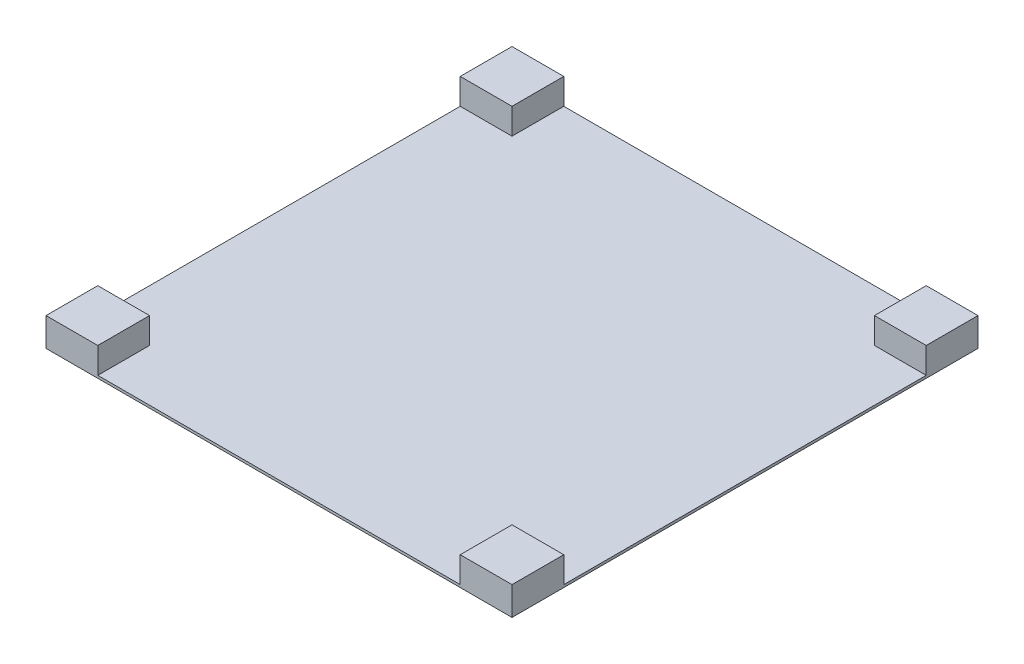
ISO-10303-21;
HEADER;
FILE_DESCRIPTION(('STEP AP214'),'2;1');
FILE_NAME('part.step','',(''),(''),'','','');
FILE_SCHEMA(('AUTOMOTIVE_DESIGN { 1 0 10303 214 1 1 1 1 }'));
ENDSEC;
DATA;
#1=APPLICATION_CONTEXT('core data for automotive mechanical design processes');
#2=APPLICATION_PROTOCOL_DEFINITION('international standard','automotive_design',2000,#1);
#3=PRODUCT_CONTEXT('',#1,'mechanical');
#4=PRODUCT('Part','Part','',(#3));
#5=PRODUCT_RELATED_PRODUCT_CATEGORY('part','',(#4));
#6=PRODUCT_DEFINITION_FORMATION('','',#4);
#7=PRODUCT_DEFINITION_CONTEXT('part definition',#1,'design');
#8=PRODUCT_DEFINITION('design','',#6,#7);
#9=PRODUCT_DEFINITION_SHAPE('','',#8);
#10=(LENGTH_UNIT() NAMED_UNIT(*) SI_UNIT(.MILLI.,.METRE.));
#11=(NAMED_UNIT(*) PLANE_ANGLE_UNIT() SI_UNIT($,.RADIAN.));
#12=(NAMED_UNIT(*) SI_UNIT($,.STERADIAN.) SOLID_ANGLE_UNIT());
#13=UNCERTAINTY_MEASURE_WITH_UNIT(LENGTH_MEASURE(1.E-05),#10,'distance_accuracy_value','');
#14=(GEOMETRIC_REPRESENTATION_CONTEXT(3) GLOBAL_UNCERTAINTY_ASSIGNED_CONTEXT((#13)) GLOBAL_UNIT_ASSIGNED_CONTEXT((#10,
#11,#12)) REPRESENTATION_CONTEXT('',''));
#15=CARTESIAN_POINT('',(0.,0.,0.));
#16=DIRECTION('',(0.,0.,1.));
#17=DIRECTION('',(1.,0.,0.));
#18=AXIS2_PLACEMENT_3D('',#15,#16,#17);
#19=CARTESIAN_POINT('',(0.,5.,0.));
#20=DIRECTION('',(0.,1.,0.));
#21=DIRECTION('',(0.,0.,1.));
#22=AXIS2_PLACEMENT_3D('',#19,#20,#21);
#23=PLANE('',#22);
#24=DIRECTION('',(-1.,0.,0.));
#25=VECTOR('',#24,1.);
#26=CARTESIAN_POINT('',(-450.,5.,350.));
#27=LINE('',#26,#25);
#28=CARTESIAN_POINT('',(-350.,5.,350.));
#29=VERTEX_POINT('',#28);
#30=CARTESIAN_POINT('',(-450.,5.,350.));
#31=VERTEX_POINT('',#30);
#32=EDGE_CURVE('E55',#29,#31,#27,.T.);
#33=ORIENTED_EDGE('',*,*,#32,.F.);
#34=DIRECTION('',(0.,0.,-1.));
#35=VECTOR('',#34,1.);
#36=CARTESIAN_POINT('',(-350.,5.,350.));
#37=LINE('',#36,#35);
#38=CARTESIAN_POINT('',(-350.,5.,450.));
#39=VERTEX_POINT('',#38);
#40=EDGE_CURVE('E176',#39,#29,#37,.T.);
#41=ORIENTED_EDGE('',*,*,#40,.F.);
#42=DIRECTION('',(1.,0.,0.));
#43=VECTOR('',#42,1.);
#44=CARTESIAN_POINT('',(-450.,5.,450.));
#45=LINE('',#44,#43);
#46=CARTESIAN_POINT('',(350.,5.,450.));
#47=VERTEX_POINT('',#46);
#48=EDGE_CURVE('E293',#39,#47,#45,.T.);
#49=ORIENTED_EDGE('',*,*,#48,.T.);
#50=DIRECTION('',(0.,0.,1.));
#51=VECTOR('',#50,1.);
#52=CARTESIAN_POINT('',(350.,5.,350.));
#53=LINE('',#52,#51);
#54=CARTESIAN_POINT('',(350.,5.,350.));
#55=VERTEX_POINT('',#54);
#56=EDGE_CURVE('E183',#55,#47,#53,.T.);
#57=ORIENTED_EDGE('',*,*,#56,.F.);
#58=DIRECTION('',(-1.,0.,0.));
#59=VECTOR('',#58,1.);
#60=CARTESIAN_POINT('',(350.,5.,350.));
#61=LINE('',#60,#59);
#62=CARTESIAN_POINT('',(450.,5.,350.));
#63=VERTEX_POINT('',#62);
#64=EDGE_CURVE('E178',#63,#55,#61,.T.);
#65=ORIENTED_EDGE('',*,*,#64,.F.);
#66=DIRECTION('',(0.,0.,-1.));
#67=VECTOR('',#66,1.);
#68=CARTESIAN_POINT('',(450.,5.,-450.));
#69=LINE('',#68,#67);
#70=CARTESIAN_POINT('',(450.,5.,-350.));
#71=VERTEX_POINT('',#70);
#72=EDGE_CURVE('E284',#63,#71,#69,.T.);
#73=ORIENTED_EDGE('',*,*,#72,.T.);
#74=DIRECTION('',(1.,0.,0.));
#75=VECTOR('',#74,1.);
#76=CARTESIAN_POINT('',(350.,5.,-350.));
#77=LINE('',#76,#75);
#78=CARTESIAN_POINT('',(350.,5.,-350.));
#79=VERTEX_POINT('',#78);
#80=EDGE_CURVE('E224',#79,#71,#77,.T.);
#81=ORIENTED_EDGE('',*,*,#80,.F.);
#82=DIRECTION('',(0.,0.,1.));
#83=VECTOR('',#82,1.);
#84=CARTESIAN_POINT('',(350.,5.,-450.));
#85=LINE('',#84,#83);
#86=CARTESIAN_POINT('',(350.,5.,-450.));
#87=VERTEX_POINT('',#86);
#88=EDGE_CURVE('E218',#87,#79,#85,.T.);
#89=ORIENTED_EDGE('',*,*,#88,.F.);
#90=DIRECTION('',(-1.,0.,0.));
#91=VECTOR('',#90,1.);
#92=CARTESIAN_POINT('',(-450.,5.,-450.));
#93=LINE('',#92,#91);
#94=CARTESIAN_POINT('',(-350.,5.,-450.));
#95=VERTEX_POINT('',#94);
#96=EDGE_CURVE('E287',#87,#95,#93,.T.);
#97=ORIENTED_EDGE('',*,*,#96,.T.);
#98=DIRECTION('',(0.,0.,-1.));
#99=VECTOR('',#98,1.);
#100=CARTESIAN_POINT('',(-350.,5.,-450.));
#101=LINE('',#100,#99);
#102=CARTESIAN_POINT('',(-350.,5.,-350.));
#103=VERTEX_POINT('',#102);
#104=EDGE_CURVE('E249',#103,#95,#101,.T.);
#105=ORIENTED_EDGE('',*,*,#104,.F.);
#106=DIRECTION('',(1.,0.,0.));
#107=VECTOR('',#106,1.);
#108=CARTESIAN_POINT('',(-450.,5.,-350.));
#109=LINE('',#108,#107);
#110=CARTESIAN_POINT('',(-450.,5.,-350.));
#111=VERTEX_POINT('',#110);
#112=EDGE_CURVE('E255',#111,#103,#109,.T.);
#113=ORIENTED_EDGE('',*,*,#112,.F.);
#114=DIRECTION('',(0.,0.,1.));
#115=VECTOR('',#114,1.);
#116=CARTESIAN_POINT('',(-450.,5.,-450.));
#117=LINE('',#116,#115);
#118=EDGE_CURVE('E60',#111,#31,#117,.T.);
#119=ORIENTED_EDGE('',*,*,#118,.T.);
#120=EDGE_LOOP('',(#33,#41,#49,#57,#65,#73,#81,#89,#97,#105,#113,#119));
#121=FACE_BOUND('',#120,.T.);
#122=ADVANCED_FACE('F39',(#121),#23,.T.);
#123=CARTESIAN_POINT('',(450.,5.,-450.));
#124=DIRECTION('',(-1.,0.,0.));
#125=DIRECTION('',(0.,0.,1.));
#126=AXIS2_PLACEMENT_3D('',#123,#124,#125);
#127=PLANE('',#126);
#128=DIRECTION('',(0.,0.,-1.));
#129=VECTOR('',#128,1.);
#130=CARTESIAN_POINT('',(450.,0.,-450.));
#131=LINE('',#130,#129);
#132=CARTESIAN_POINT('',(450.,0.,450.));
#133=VERTEX_POINT('',#132);
#134=CARTESIAN_POINT('',(450.,0.,-450.));
#135=VERTEX_POINT('',#134);
#136=EDGE_CURVE('E283',#133,#135,#131,.T.);
#137=ORIENTED_EDGE('',*,*,#136,.T.);
#138=DIRECTION('',(0.,-1.,0.));
#139=VECTOR('',#138,1.);
#140=CARTESIAN_POINT('',(450.,5.,-450.));
#141=LINE('',#140,#139);
#142=CARTESIAN_POINT('',(450.,55.,-450.));
#143=VERTEX_POINT('',#142);
#144=EDGE_CURVE('E11',#143,#135,#141,.T.);
#145=ORIENTED_EDGE('',*,*,#144,.F.);
#146=DIRECTION('',(0.,0.,-1.));
#147=VECTOR('',#146,1.);
#148=CARTESIAN_POINT('',(450.,55.,-450.));
#149=LINE('',#148,#147);
#150=CARTESIAN_POINT('',(450.,55.,-350.));
#151=VERTEX_POINT('',#150);
#152=EDGE_CURVE('E219',#151,#143,#149,.T.);
#153=ORIENTED_EDGE('',*,*,#152,.F.);
#154=DIRECTION('',(0.,-1.,0.));
#155=VECTOR('',#154,1.);
#156=CARTESIAN_POINT('',(450.,55.,-350.));
#157=LINE('',#156,#155);
#158=EDGE_CURVE('E233',#151,#71,#157,.T.);
#159=ORIENTED_EDGE('',*,*,#158,.T.);
#160=ORIENTED_EDGE('',*,*,#72,.F.);
#161=DIRECTION('',(0.,-1.,0.));
#162=VECTOR('',#161,1.);
#163=CARTESIAN_POINT('',(450.,55.,350.));
#164=LINE('',#163,#162);
#165=CARTESIAN_POINT('',(450.,55.,350.));
#166=VERTEX_POINT('',#165);
#167=EDGE_CURVE('E214',#166,#63,#164,.T.);
#168=ORIENTED_EDGE('',*,*,#167,.F.);
#169=DIRECTION('',(0.,0.,-1.));
#170=VECTOR('',#169,1.);
#171=CARTESIAN_POINT('',(450.,55.,350.));
#172=LINE('',#171,#170);
#173=CARTESIAN_POINT('',(450.,55.,450.));
#174=VERTEX_POINT('',#173);
#175=EDGE_CURVE('E189',#174,#166,#172,.T.);
#176=ORIENTED_EDGE('',*,*,#175,.F.);
#177=DIRECTION('',(0.,-1.,0.));
#178=VECTOR('',#177,1.);
#179=CARTESIAN_POINT('',(450.,5.,450.));
#180=LINE('',#179,#178);
#181=EDGE_CURVE('E296',#174,#133,#180,.T.);
#182=ORIENTED_EDGE('',*,*,#181,.T.);
#183=EDGE_LOOP('',(#137,#145,#153,#159,#160,#168,#176,#182));
#184=FACE_BOUND('',#183,.T.);
#185=ADVANCED_FACE('F41',(#184),#127,.F.);
#186=CARTESIAN_POINT('',(-450.,5.,-450.));
#187=DIRECTION('',(0.,0.,1.));
#188=DIRECTION('',(1.,0.,0.));
#189=AXIS2_PLACEMENT_3D('',#186,#187,#188);
#190=PLANE('',#189);
#191=DIRECTION('',(-1.,0.,0.));
#192=VECTOR('',#191,1.);
#193=CARTESIAN_POINT('',(-450.,0.,-450.));
#194=LINE('',#193,#192);
#195=CARTESIAN_POINT('',(-450.,0.,-450.));
#196=VERTEX_POINT('',#195);
#197=EDGE_CURVE('E300',#135,#196,#194,.T.);
#198=ORIENTED_EDGE('',*,*,#197,.T.);
#199=DIRECTION('',(0.,-1.,0.));
#200=VECTOR('',#199,1.);
#201=CARTESIAN_POINT('',(-450.,5.,-450.));
#202=LINE('',#201,#200);
#203=CARTESIAN_POINT('',(-450.,55.,-450.));
#204=VERTEX_POINT('',#203);
#205=EDGE_CURVE('E48',#204,#196,#202,.T.);
#206=ORIENTED_EDGE('',*,*,#205,.F.);
#207=DIRECTION('',(-1.,0.,0.));
#208=VECTOR('',#207,1.);
#209=CARTESIAN_POINT('',(-450.,55.,-450.));
#210=LINE('',#209,#208);
#211=CARTESIAN_POINT('',(-350.,55.,-450.));
#212=VERTEX_POINT('',#211);
#213=EDGE_CURVE('E254',#212,#204,#210,.T.);
#214=ORIENTED_EDGE('',*,*,#213,.F.);
#215=DIRECTION('',(0.,-1.,0.));
#216=VECTOR('',#215,1.);
#217=CARTESIAN_POINT('',(-350.,55.,-450.));
#218=LINE('',#217,#216);
#219=EDGE_CURVE('E279',#212,#95,#218,.T.);
#220=ORIENTED_EDGE('',*,*,#219,.T.);
#221=ORIENTED_EDGE('',*,*,#96,.F.);
#222=DIRECTION('',(0.,-1.,0.));
#223=VECTOR('',#222,1.);
#224=CARTESIAN_POINT('',(350.,55.,-450.));
#225=LINE('',#224,#223);
#226=CARTESIAN_POINT('',(350.,55.,-450.));
#227=VERTEX_POINT('',#226);
#228=EDGE_CURVE('E246',#227,#87,#225,.T.);
#229=ORIENTED_EDGE('',*,*,#228,.F.);
#230=DIRECTION('',(-1.,0.,0.));
#231=VECTOR('',#230,1.);
#232=CARTESIAN_POINT('',(350.,55.,-450.));
#233=LINE('',#232,#231);
#234=EDGE_CURVE('E223',#143,#227,#233,.T.);
#235=ORIENTED_EDGE('',*,*,#234,.F.);
#236=ORIENTED_EDGE('',*,*,#144,.T.);
#237=EDGE_LOOP('',(#198,#206,#214,#220,#221,#229,#235,#236));
#238=FACE_BOUND('',#237,.T.);
#239=ADVANCED_FACE('F358',(#238),#190,.F.);
#240=CARTESIAN_POINT('',(-450.,5.,-450.));
#241=DIRECTION('',(1.,0.,0.));
#242=DIRECTION('',(0.,0.,-1.));
#243=AXIS2_PLACEMENT_3D('',#240,#241,#242);
#244=PLANE('',#243);
#245=DIRECTION('',(0.,0.,1.));
#246=VECTOR('',#245,1.);
#247=CARTESIAN_POINT('',(-450.,0.,-450.));
#248=LINE('',#247,#246);
#249=CARTESIAN_POINT('',(-450.,0.,450.));
#250=VERTEX_POINT('',#249);
#251=EDGE_CURVE('E303',#196,#250,#248,.T.);
#252=ORIENTED_EDGE('',*,*,#251,.T.);
#253=DIRECTION('',(0.,-1.,0.));
#254=VECTOR('',#253,1.);
#255=CARTESIAN_POINT('',(-450.,5.,450.));
#256=LINE('',#255,#254);
#257=CARTESIAN_POINT('',(-450.,55.,450.));
#258=VERTEX_POINT('',#257);
#259=EDGE_CURVE('E311',#258,#250,#256,.T.);
#260=ORIENTED_EDGE('',*,*,#259,.F.);
#261=DIRECTION('',(0.,0.,1.));
#262=VECTOR('',#261,1.);
#263=CARTESIAN_POINT('',(-450.,55.,350.));
#264=LINE('',#263,#262);
#265=CARTESIAN_POINT('',(-450.,55.,350.));
#266=VERTEX_POINT('',#265);
#267=EDGE_CURVE('E163',#266,#258,#264,.T.);
#268=ORIENTED_EDGE('',*,*,#267,.F.);
#269=DIRECTION('',(0.,-1.,0.));
#270=VECTOR('',#269,1.);
#271=CARTESIAN_POINT('',(-450.,55.,350.));
#272=LINE('',#271,#270);
#273=EDGE_CURVE('E158',#266,#31,#272,.T.);
#274=ORIENTED_EDGE('',*,*,#273,.T.);
#275=ORIENTED_EDGE('',*,*,#118,.F.);
#276=DIRECTION('',(0.,-1.,0.));
#277=VECTOR('',#276,1.);
#278=CARTESIAN_POINT('',(-450.,55.,-350.));
#279=LINE('',#278,#277);
#280=CARTESIAN_POINT('',(-450.,55.,-350.));
#281=VERTEX_POINT('',#280);
#282=EDGE_CURVE('E275',#281,#111,#279,.T.);
#283=ORIENTED_EDGE('',*,*,#282,.F.);
#284=DIRECTION('',(0.,0.,1.));
#285=VECTOR('',#284,1.);
#286=CARTESIAN_POINT('',(-450.,55.,-450.));
#287=LINE('',#286,#285);
#288=EDGE_CURVE('E259',#204,#281,#287,.T.);
#289=ORIENTED_EDGE('',*,*,#288,.F.);
#290=ORIENTED_EDGE('',*,*,#205,.T.);
#291=EDGE_LOOP('',(#252,#260,#268,#274,#275,#283,#289,#290));
#292=FACE_BOUND('',#291,.T.);
#293=ADVANCED_FACE('F319',(#292),#244,.F.);
#294=CARTESIAN_POINT('',(-450.,5.,450.));
#295=DIRECTION('',(0.,0.,-1.));
#296=DIRECTION('',(-1.,0.,0.));
#297=AXIS2_PLACEMENT_3D('',#294,#295,#296);
#298=PLANE('',#297);
#299=DIRECTION('',(1.,0.,0.));
#300=VECTOR('',#299,1.);
#301=CARTESIAN_POINT('',(-450.,0.,450.));
#302=LINE('',#301,#300);
#303=EDGE_CURVE('E288',#250,#133,#302,.T.);
#304=ORIENTED_EDGE('',*,*,#303,.T.);
#305=ORIENTED_EDGE('',*,*,#181,.F.);
#306=DIRECTION('',(1.,0.,0.));
#307=VECTOR('',#306,1.);
#308=CARTESIAN_POINT('',(350.,55.,450.));
#309=LINE('',#308,#307);
#310=CARTESIAN_POINT('',(350.,55.,450.));
#311=VERTEX_POINT('',#310);
#312=EDGE_CURVE('E199',#311,#174,#309,.T.);
#313=ORIENTED_EDGE('',*,*,#312,.F.);
#314=DIRECTION('',(0.,-1.,0.));
#315=VECTOR('',#314,1.);
#316=CARTESIAN_POINT('',(350.,55.,450.));
#317=LINE('',#316,#315);
#318=EDGE_CURVE('E202',#311,#47,#317,.T.);
#319=ORIENTED_EDGE('',*,*,#318,.T.);
#320=ORIENTED_EDGE('',*,*,#48,.F.);
#321=DIRECTION('',(0.,-1.,0.));
#322=VECTOR('',#321,1.);
#323=CARTESIAN_POINT('',(-350.,55.,450.));
#324=LINE('',#323,#322);
#325=CARTESIAN_POINT('',(-350.,55.,450.));
#326=VERTEX_POINT('',#325);
#327=EDGE_CURVE('E185',#326,#39,#324,.T.);
#328=ORIENTED_EDGE('',*,*,#327,.F.);
#329=DIRECTION('',(1.,0.,0.));
#330=VECTOR('',#329,1.);
#331=CARTESIAN_POINT('',(-450.,55.,450.));
#332=LINE('',#331,#330);
#333=EDGE_CURVE('E169',#258,#326,#332,.T.);
#334=ORIENTED_EDGE('',*,*,#333,.F.);
#335=ORIENTED_EDGE('',*,*,#259,.T.);
#336=EDGE_LOOP('',(#304,#305,#313,#319,#320,#328,#334,#335));
#337=FACE_BOUND('',#336,.T.);
#338=ADVANCED_FACE('F327',(#337),#298,.F.);
#339=CARTESIAN_POINT('',(0.,0.,0.));
#340=DIRECTION('',(0.,1.,0.));
#341=DIRECTION('',(0.,0.,1.));
#342=AXIS2_PLACEMENT_3D('',#339,#340,#341);
#343=PLANE('',#342);
#344=ORIENTED_EDGE('',*,*,#136,.F.);
#345=ORIENTED_EDGE('',*,*,#303,.F.);
#346=ORIENTED_EDGE('',*,*,#251,.F.);
#347=ORIENTED_EDGE('',*,*,#197,.F.);
#348=EDGE_LOOP('',(#344,#345,#346,#347));
#349=FACE_BOUND('',#348,.T.);
#350=ADVANCED_FACE('F325',(#349),#343,.F.);
#351=CARTESIAN_POINT('',(-350.,55.,-450.));
#352=DIRECTION('',(-1.,0.,0.));
#353=DIRECTION('',(0.,0.,1.));
#354=AXIS2_PLACEMENT_3D('',#351,#352,#353);
#355=PLANE('',#354);
#356=ORIENTED_EDGE('',*,*,#104,.T.);
#357=ORIENTED_EDGE('',*,*,#219,.F.);
#358=DIRECTION('',(0.,0.,-1.));
#359=VECTOR('',#358,1.);
#360=CARTESIAN_POINT('',(-350.,55.,-450.));
#361=LINE('',#360,#359);
#362=CARTESIAN_POINT('',(-350.,55.,-350.));
#363=VERTEX_POINT('',#362);
#364=EDGE_CURVE('E250',#363,#212,#361,.T.);
#365=ORIENTED_EDGE('',*,*,#364,.F.);
#366=DIRECTION('',(0.,-1.,0.));
#367=VECTOR('',#366,1.);
#368=CARTESIAN_POINT('',(-350.,55.,-350.));
#369=LINE('',#368,#367);
#370=EDGE_CURVE('E265',#363,#103,#369,.T.);
#371=ORIENTED_EDGE('',*,*,#370,.T.);
#372=EDGE_LOOP('',(#356,#357,#365,#371));
#373=FACE_BOUND('',#372,.T.);
#374=ADVANCED_FACE('F361',(#373),#355,.F.);
#375=CARTESIAN_POINT('',(-450.,55.,-350.));
#376=DIRECTION('',(0.,0.,-1.));
#377=DIRECTION('',(-1.,0.,0.));
#378=AXIS2_PLACEMENT_3D('',#375,#376,#377);
#379=PLANE('',#378);
#380=ORIENTED_EDGE('',*,*,#112,.T.);
#381=ORIENTED_EDGE('',*,*,#370,.F.);
#382=DIRECTION('',(1.,0.,0.));
#383=VECTOR('',#382,1.);
#384=CARTESIAN_POINT('',(-450.,55.,-350.));
#385=LINE('',#384,#383);
#386=EDGE_CURVE('E262',#281,#363,#385,.T.);
#387=ORIENTED_EDGE('',*,*,#386,.F.);
#388=ORIENTED_EDGE('',*,*,#282,.T.);
#389=EDGE_LOOP('',(#380,#381,#387,#388));
#390=FACE_BOUND('',#389,.T.);
#391=ADVANCED_FACE('F388',(#390),#379,.F.);
#392=CARTESIAN_POINT('',(0.,55.,0.));
#393=DIRECTION('',(0.,1.,0.));
#394=DIRECTION('',(0.,0.,1.));
#395=AXIS2_PLACEMENT_3D('',#392,#393,#394);
#396=PLANE('',#395);
#397=ORIENTED_EDGE('',*,*,#364,.T.);
#398=ORIENTED_EDGE('',*,*,#213,.T.);
#399=ORIENTED_EDGE('',*,*,#288,.T.);
#400=ORIENTED_EDGE('',*,*,#386,.T.);
#401=EDGE_LOOP('',(#397,#398,#399,#400));
#402=FACE_BOUND('',#401,.T.);
#403=ADVANCED_FACE('F400',(#402),#396,.T.);
#404=CARTESIAN_POINT('',(350.,55.,-450.));
#405=DIRECTION('',(1.,0.,0.));
#406=DIRECTION('',(0.,0.,-1.));
#407=AXIS2_PLACEMENT_3D('',#404,#405,#406);
#408=PLANE('',#407);
#409=ORIENTED_EDGE('',*,*,#88,.T.);
#410=DIRECTION('',(0.,-1.,0.));
#411=VECTOR('',#410,1.);
#412=CARTESIAN_POINT('',(350.,55.,-350.));
#413=LINE('',#412,#411);
#414=CARTESIAN_POINT('',(350.,55.,-350.));
#415=VERTEX_POINT('',#414);
#416=EDGE_CURVE('E243',#415,#79,#413,.T.);
#417=ORIENTED_EDGE('',*,*,#416,.F.);
#418=DIRECTION('',(0.,0.,1.));
#419=VECTOR('',#418,1.);
#420=CARTESIAN_POINT('',(350.,55.,-450.));
#421=LINE('',#420,#419);
#422=EDGE_CURVE('E227',#227,#415,#421,.T.);
#423=ORIENTED_EDGE('',*,*,#422,.F.);
#424=ORIENTED_EDGE('',*,*,#228,.T.);
#425=EDGE_LOOP('',(#409,#417,#423,#424));
#426=FACE_BOUND('',#425,.T.);
#427=ADVANCED_FACE('F402',(#426),#408,.F.);
#428=CARTESIAN_POINT('',(350.,55.,-350.));
#429=DIRECTION('',(0.,0.,-1.));
#430=DIRECTION('',(-1.,0.,0.));
#431=AXIS2_PLACEMENT_3D('',#428,#429,#430);
#432=PLANE('',#431);
#433=ORIENTED_EDGE('',*,*,#80,.T.);
#434=ORIENTED_EDGE('',*,*,#158,.F.);
#435=DIRECTION('',(1.,0.,0.));
#436=VECTOR('',#435,1.);
#437=CARTESIAN_POINT('',(350.,55.,-350.));
#438=LINE('',#437,#436);
#439=EDGE_CURVE('E230',#415,#151,#438,.T.);
#440=ORIENTED_EDGE('',*,*,#439,.F.);
#441=ORIENTED_EDGE('',*,*,#416,.T.);
#442=EDGE_LOOP('',(#433,#434,#440,#441));
#443=FACE_BOUND('',#442,.T.);
#444=ADVANCED_FACE('F350',(#443),#432,.F.);
#445=CARTESIAN_POINT('',(0.,55.,0.));
#446=DIRECTION('',(0.,1.,0.));
#447=DIRECTION('',(0.,0.,1.));
#448=AXIS2_PLACEMENT_3D('',#445,#446,#447);
#449=PLANE('',#448);
#450=ORIENTED_EDGE('',*,*,#152,.T.);
#451=ORIENTED_EDGE('',*,*,#234,.T.);
#452=ORIENTED_EDGE('',*,*,#422,.T.);
#453=ORIENTED_EDGE('',*,*,#439,.T.);
#454=EDGE_LOOP('',(#450,#451,#452,#453));
#455=FACE_BOUND('',#454,.T.);
#456=ADVANCED_FACE('F343',(#455),#449,.T.);
#457=CARTESIAN_POINT('',(350.,55.,350.));
#458=DIRECTION('',(0.,0.,1.));
#459=DIRECTION('',(1.,0.,0.));
#460=AXIS2_PLACEMENT_3D('',#457,#458,#459);
#461=PLANE('',#460);
#462=ORIENTED_EDGE('',*,*,#64,.T.);
#463=DIRECTION('',(0.,-1.,0.));
#464=VECTOR('',#463,1.);
#465=CARTESIAN_POINT('',(350.,55.,350.));
#466=LINE('',#465,#464);
#467=CARTESIAN_POINT('',(350.,55.,350.));
#468=VERTEX_POINT('',#467);
#469=EDGE_CURVE('E210',#468,#55,#466,.T.);
#470=ORIENTED_EDGE('',*,*,#469,.F.);
#471=DIRECTION('',(-1.,0.,0.));
#472=VECTOR('',#471,1.);
#473=CARTESIAN_POINT('',(350.,55.,350.));
#474=LINE('',#473,#472);
#475=EDGE_CURVE('E193',#166,#468,#474,.T.);
#476=ORIENTED_EDGE('',*,*,#475,.F.);
#477=ORIENTED_EDGE('',*,*,#167,.T.);
#478=EDGE_LOOP('',(#462,#470,#476,#477));
#479=FACE_BOUND('',#478,.T.);
#480=ADVANCED_FACE('F341',(#479),#461,.F.);
#481=CARTESIAN_POINT('',(350.,55.,350.));
#482=DIRECTION('',(1.,0.,0.));
#483=DIRECTION('',(0.,0.,-1.));
#484=AXIS2_PLACEMENT_3D('',#481,#482,#483);
#485=PLANE('',#484);
#486=ORIENTED_EDGE('',*,*,#56,.T.);
#487=ORIENTED_EDGE('',*,*,#318,.F.);
#488=DIRECTION('',(0.,0.,1.));
#489=VECTOR('',#488,1.);
#490=CARTESIAN_POINT('',(350.,55.,350.));
#491=LINE('',#490,#489);
#492=EDGE_CURVE('E196',#468,#311,#491,.T.);
#493=ORIENTED_EDGE('',*,*,#492,.F.);
#494=ORIENTED_EDGE('',*,*,#469,.T.);
#495=EDGE_LOOP('',(#486,#487,#493,#494));
#496=FACE_BOUND('',#495,.T.);
#497=ADVANCED_FACE('F339',(#496),#485,.F.);
#498=CARTESIAN_POINT('',(0.,55.,0.));
#499=DIRECTION('',(0.,1.,0.));
#500=DIRECTION('',(0.,0.,1.));
#501=AXIS2_PLACEMENT_3D('',#498,#499,#500);
#502=PLANE('',#501);
#503=ORIENTED_EDGE('',*,*,#175,.T.);
#504=ORIENTED_EDGE('',*,*,#475,.T.);
#505=ORIENTED_EDGE('',*,*,#492,.T.);
#506=ORIENTED_EDGE('',*,*,#312,.T.);
#507=EDGE_LOOP('',(#503,#504,#505,#506));
#508=FACE_BOUND('',#507,.T.);
#509=ADVANCED_FACE('F334',(#508),#502,.T.);
#510=CARTESIAN_POINT('',(-350.,55.,350.));
#511=DIRECTION('',(-1.,0.,0.));
#512=DIRECTION('',(0.,0.,1.));
#513=AXIS2_PLACEMENT_3D('',#510,#511,#512);
#514=PLANE('',#513);
#515=ORIENTED_EDGE('',*,*,#40,.T.);
#516=DIRECTION('',(0.,-1.,0.));
#517=VECTOR('',#516,1.);
#518=CARTESIAN_POINT('',(-350.,55.,350.));
#519=LINE('',#518,#517);
#520=CARTESIAN_POINT('',(-350.,55.,350.));
#521=VERTEX_POINT('',#520);
#522=EDGE_CURVE('E155',#521,#29,#519,.T.);
#523=ORIENTED_EDGE('',*,*,#522,.F.);
#524=DIRECTION('',(0.,0.,-1.));
#525=VECTOR('',#524,1.);
#526=CARTESIAN_POINT('',(-350.,55.,350.));
#527=LINE('',#526,#525);
#528=EDGE_CURVE('E164',#326,#521,#527,.T.);
#529=ORIENTED_EDGE('',*,*,#528,.F.);
#530=ORIENTED_EDGE('',*,*,#327,.T.);
#531=EDGE_LOOP('',(#515,#523,#529,#530));
#532=FACE_BOUND('',#531,.T.);
#533=ADVANCED_FACE('F175',(#532),#514,.F.);
#534=CARTESIAN_POINT('',(-450.,55.,350.));
#535=DIRECTION('',(0.,0.,1.));
#536=DIRECTION('',(1.,0.,0.));
#537=AXIS2_PLACEMENT_3D('',#534,#535,#536);
#538=PLANE('',#537);
#539=ORIENTED_EDGE('',*,*,#32,.T.);
#540=ORIENTED_EDGE('',*,*,#273,.F.);
#541=DIRECTION('',(-1.,0.,0.));
#542=VECTOR('',#541,1.);
#543=CARTESIAN_POINT('',(-450.,55.,350.));
#544=LINE('',#543,#542);
#545=EDGE_CURVE('E151',#521,#266,#544,.T.);
#546=ORIENTED_EDGE('',*,*,#545,.F.);
#547=ORIENTED_EDGE('',*,*,#522,.T.);
#548=EDGE_LOOP('',(#539,#540,#546,#547));
#549=FACE_BOUND('',#548,.T.);
#550=ADVANCED_FACE('F153',(#549),#538,.F.);
#551=CARTESIAN_POINT('',(0.,55.,0.));
#552=DIRECTION('',(0.,1.,0.));
#553=DIRECTION('',(0.,0.,1.));
#554=AXIS2_PLACEMENT_3D('',#551,#552,#553);
#555=PLANE('',#554);
#556=ORIENTED_EDGE('',*,*,#528,.T.);
#557=ORIENTED_EDGE('',*,*,#545,.T.);
#558=ORIENTED_EDGE('',*,*,#267,.T.);
#559=ORIENTED_EDGE('',*,*,#333,.T.);
#560=EDGE_LOOP('',(#556,#557,#558,#559));
#561=FACE_BOUND('',#560,.T.);
#562=ADVANCED_FACE('F167',(#561),#555,.T.);
#563=CLOSED_SHELL('',(#122,#185,#239,#293,#338,#350,#374,#391,#403,#427,#444,#456,#480,#497,
#509,#533,#550,#562));
#564=MANIFOLD_SOLID_BREP('B2',#563);
#565=ADVANCED_BREP_SHAPE_REPRESENTATION('',(#18,#564),#14);
#566=SHAPE_DEFINITION_REPRESENTATION(#9,#565);
ENDSEC;
END-ISO-10303-21;
